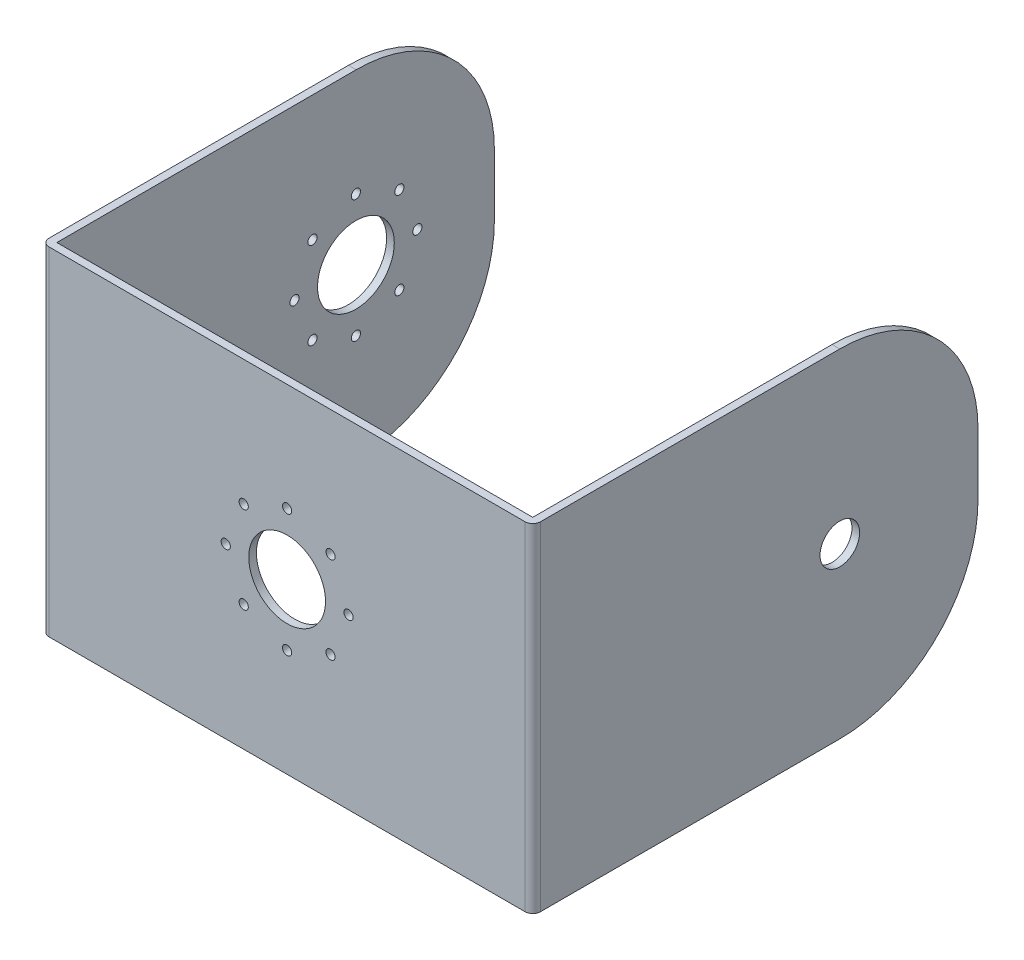
ISO-10303-21;
HEADER;
FILE_DESCRIPTION(('STEP AP214'),'2;1');
FILE_NAME('part.step','',(''),(''),'','','');
FILE_SCHEMA(('AUTOMOTIVE_DESIGN { 1 0 10303 214 1 1 1 1 }'));
ENDSEC;
DATA;
#1=APPLICATION_CONTEXT('core data for automotive mechanical design processes');
#2=APPLICATION_PROTOCOL_DEFINITION('international standard','automotive_design',2000,#1);
#3=PRODUCT_CONTEXT('',#1,'mechanical');
#4=PRODUCT('Part','Part','',(#3));
#5=PRODUCT_RELATED_PRODUCT_CATEGORY('part','',(#4));
#6=PRODUCT_DEFINITION_FORMATION('','',#4);
#7=PRODUCT_DEFINITION_CONTEXT('part definition',#1,'design');
#8=PRODUCT_DEFINITION('design','',#6,#7);
#9=PRODUCT_DEFINITION_SHAPE('','',#8);
#10=(LENGTH_UNIT() NAMED_UNIT(*) SI_UNIT(.MILLI.,.METRE.));
#11=(NAMED_UNIT(*) PLANE_ANGLE_UNIT() SI_UNIT($,.RADIAN.));
#12=(NAMED_UNIT(*) SI_UNIT($,.STERADIAN.) SOLID_ANGLE_UNIT());
#13=UNCERTAINTY_MEASURE_WITH_UNIT(LENGTH_MEASURE(1.E-05),#10,'distance_accuracy_value','');
#14=(GEOMETRIC_REPRESENTATION_CONTEXT(3) GLOBAL_UNCERTAINTY_ASSIGNED_CONTEXT((#13)) GLOBAL_UNIT_ASSIGNED_CONTEXT((#10,
#11,#12)) REPRESENTATION_CONTEXT('',''));
#15=CARTESIAN_POINT('',(0.,0.,0.));
#16=DIRECTION('',(0.,0.,1.));
#17=DIRECTION('',(1.,0.,0.));
#18=AXIS2_PLACEMENT_3D('',#15,#16,#17);
#19=CARTESIAN_POINT('',(32.,44.,0.));
#20=DIRECTION('',(-1.,0.,0.));
#21=DIRECTION('',(0.,0.,1.));
#22=AXIS2_PLACEMENT_3D('',#19,#20,#21);
#23=PLANE('',#22);
#24=CARTESIAN_POINT('',(32.,22.,-39.));
#25=DIRECTION('',(1.,0.,0.));
#26=DIRECTION('',(0.,0.,-1.));
#27=AXIS2_PLACEMENT_3D('',#24,#25,#26);
#28=CIRCLE('',#27,2.58);
#29=CARTESIAN_POINT('',(32.,22.,-41.58));
#30=VERTEX_POINT('',#29);
#31=EDGE_CURVE('E196',#30,#30,#28,.T.);
#32=ORIENTED_EDGE('',*,*,#31,.F.);
#33=EDGE_LOOP('',(#32));
#34=FACE_BOUND('',#33,.T.);
#35=DIRECTION('',(0.,0.,-1.));
#36=VECTOR('',#35,1.);
#37=CARTESIAN_POINT('',(32.,44.,0.));
#38=LINE('',#37,#36);
#39=CARTESIAN_POINT('',(32.,44.,0.));
#40=VERTEX_POINT('',#39);
#41=CARTESIAN_POINT('',(32.,44.,-39.));
#42=VERTEX_POINT('',#41);
#43=EDGE_CURVE('E155',#40,#42,#38,.T.);
#44=ORIENTED_EDGE('',*,*,#43,.F.);
#45=DIRECTION('',(0.,-1.,0.));
#46=VECTOR('',#45,1.);
#47=CARTESIAN_POINT('',(32.,44.,0.));
#48=LINE('',#47,#46);
#49=CARTESIAN_POINT('',(32.,0.,0.));
#50=VERTEX_POINT('',#49);
#51=EDGE_CURVE('E243',#40,#50,#48,.T.);
#52=ORIENTED_EDGE('',*,*,#51,.T.);
#53=DIRECTION('',(0.,0.,-1.));
#54=VECTOR('',#53,1.);
#55=CARTESIAN_POINT('',(32.,0.,0.));
#56=LINE('',#55,#54);
#57=CARTESIAN_POINT('',(32.,0.,-39.));
#58=VERTEX_POINT('',#57);
#59=EDGE_CURVE('E171',#50,#58,#56,.T.);
#60=ORIENTED_EDGE('',*,*,#59,.T.);
#61=CARTESIAN_POINT('',(32.,18.,-39.));
#62=DIRECTION('',(-1.,0.,0.));
#63=DIRECTION('',(0.,0.,1.));
#64=AXIS2_PLACEMENT_3D('',#61,#62,#63);
#65=CIRCLE('',#64,18.);
#66=CARTESIAN_POINT('',(32.,18.,-57.));
#67=VERTEX_POINT('',#66);
#68=EDGE_CURVE('E199',#58,#67,#65,.F.);
#69=ORIENTED_EDGE('',*,*,#68,.T.);
#70=DIRECTION('',(0.,-1.,0.));
#71=VECTOR('',#70,1.);
#72=CARTESIAN_POINT('',(32.,44.,-57.));
#73=LINE('',#72,#71);
#74=CARTESIAN_POINT('',(32.,26.,-57.));
#75=VERTEX_POINT('',#74);
#76=EDGE_CURVE('E191',#75,#67,#73,.T.);
#77=ORIENTED_EDGE('',*,*,#76,.F.);
#78=CARTESIAN_POINT('',(32.,26.,-39.));
#79=DIRECTION('',(-1.,0.,0.));
#80=DIRECTION('',(0.,0.,1.));
#81=AXIS2_PLACEMENT_3D('',#78,#79,#80);
#82=CIRCLE('',#81,18.);
#83=EDGE_CURVE('E210',#75,#42,#82,.F.);
#84=ORIENTED_EDGE('',*,*,#83,.T.);
#85=EDGE_LOOP('',(#44,#52,#60,#69,#77,#84));
#86=FACE_BOUND('',#85,.T.);
#87=ADVANCED_FACE('F33',(#34,#86),#23,.F.);
#88=CARTESIAN_POINT('',(31.,44.,-57.));
#89=DIRECTION('',(0.,0.,-1.));
#90=DIRECTION('',(-1.,0.,0.));
#91=AXIS2_PLACEMENT_3D('',#88,#89,#90);
#92=PLANE('',#91);
#93=DIRECTION('',(0.,-1.,0.));
#94=VECTOR('',#93,1.);
#95=CARTESIAN_POINT('',(31.,44.,-57.));
#96=LINE('',#95,#94);
#97=CARTESIAN_POINT('',(31.,26.,-57.));
#98=VERTEX_POINT('',#97);
#99=CARTESIAN_POINT('',(31.,18.,-57.));
#100=VERTEX_POINT('',#99);
#101=EDGE_CURVE('E145',#98,#100,#96,.T.);
#102=ORIENTED_EDGE('',*,*,#101,.F.);
#103=DIRECTION('',(1.,0.,0.));
#104=VECTOR('',#103,1.);
#105=CARTESIAN_POINT('',(32.,26.,-57.));
#106=LINE('',#105,#104);
#107=EDGE_CURVE('E207',#98,#75,#106,.T.);
#108=ORIENTED_EDGE('',*,*,#107,.T.);
#109=ORIENTED_EDGE('',*,*,#76,.T.);
#110=DIRECTION('',(1.,0.,0.));
#111=VECTOR('',#110,1.);
#112=CARTESIAN_POINT('',(31.,18.,-57.));
#113=LINE('',#112,#111);
#114=EDGE_CURVE('E202',#67,#100,#113,.F.);
#115=ORIENTED_EDGE('',*,*,#114,.T.);
#116=EDGE_LOOP('',(#102,#108,#109,#115));
#117=FACE_BOUND('',#116,.T.);
#118=ADVANCED_FACE('F261',(#117),#92,.T.);
#119=CARTESIAN_POINT('',(31.,44.,0.));
#120=DIRECTION('',(-1.,0.,0.));
#121=DIRECTION('',(0.,0.,1.));
#122=AXIS2_PLACEMENT_3D('',#119,#120,#121);
#123=PLANE('',#122);
#124=CARTESIAN_POINT('',(31.,22.,-39.));
#125=DIRECTION('',(-1.,0.,0.));
#126=DIRECTION('',(0.,0.,1.));
#127=AXIS2_PLACEMENT_3D('',#124,#125,#126);
#128=CIRCLE('',#127,2.58);
#129=CARTESIAN_POINT('',(31.,22.,-36.42));
#130=VERTEX_POINT('',#129);
#131=EDGE_CURVE('E173',#130,#130,#128,.T.);
#132=ORIENTED_EDGE('',*,*,#131,.F.);
#133=EDGE_LOOP('',(#132));
#134=FACE_BOUND('',#133,.T.);
#135=DIRECTION('',(0.,0.,-1.));
#136=VECTOR('',#135,1.);
#137=CARTESIAN_POINT('',(31.,44.,0.));
#138=LINE('',#137,#136);
#139=CARTESIAN_POINT('',(31.,44.,0.));
#140=VERTEX_POINT('',#139);
#141=CARTESIAN_POINT('',(31.,44.,-39.));
#142=VERTEX_POINT('',#141);
#143=EDGE_CURVE('E137',#140,#142,#138,.T.);
#144=ORIENTED_EDGE('',*,*,#143,.T.);
#145=CARTESIAN_POINT('',(31.,26.,-39.));
#146=DIRECTION('',(-1.,0.,0.));
#147=DIRECTION('',(0.,0.,1.));
#148=AXIS2_PLACEMENT_3D('',#145,#146,#147);
#149=CIRCLE('',#148,18.);
#150=EDGE_CURVE('E214',#142,#98,#149,.T.);
#151=ORIENTED_EDGE('',*,*,#150,.T.);
#152=ORIENTED_EDGE('',*,*,#101,.T.);
#153=CARTESIAN_POINT('',(31.,18.,-39.));
#154=DIRECTION('',(-1.,0.,0.));
#155=DIRECTION('',(0.,0.,1.));
#156=AXIS2_PLACEMENT_3D('',#153,#154,#155);
#157=CIRCLE('',#156,18.);
#158=CARTESIAN_POINT('',(31.,0.,-39.));
#159=VERTEX_POINT('',#158);
#160=EDGE_CURVE('E205',#100,#159,#157,.T.);
#161=ORIENTED_EDGE('',*,*,#160,.T.);
#162=DIRECTION('',(0.,0.,-1.));
#163=VECTOR('',#162,1.);
#164=CARTESIAN_POINT('',(31.,0.,0.));
#165=LINE('',#164,#163);
#166=CARTESIAN_POINT('',(31.,0.,0.));
#167=VERTEX_POINT('',#166);
#168=EDGE_CURVE('E140',#167,#159,#165,.T.);
#169=ORIENTED_EDGE('',*,*,#168,.F.);
#170=DIRECTION('',(0.,-1.,0.));
#171=VECTOR('',#170,1.);
#172=CARTESIAN_POINT('',(31.,44.,0.));
#173=LINE('',#172,#171);
#174=EDGE_CURVE('E134',#140,#167,#173,.T.);
#175=ORIENTED_EDGE('',*,*,#174,.F.);
#176=EDGE_LOOP('',(#144,#151,#152,#161,#169,#175));
#177=FACE_BOUND('',#176,.T.);
#178=ADVANCED_FACE('F136',(#134,#177),#123,.T.);
#179=CARTESIAN_POINT('',(31.,44.,0.));
#180=DIRECTION('',(0.,0.,-1.));
#181=DIRECTION('',(-1.,0.,0.));
#182=AXIS2_PLACEMENT_3D('',#179,#180,#181);
#183=PLANE('',#182);
#184=CARTESIAN_POINT('',(0.,30.,0.));
#185=DIRECTION('',(0.,0.,-1.));
#186=DIRECTION('',(-1.,0.,0.));
#187=AXIS2_PLACEMENT_3D('',#184,#185,#186);
#188=CIRCLE('',#187,0.6);
#189=CARTESIAN_POINT('',(-0.6,30.,0.));
#190=VERTEX_POINT('',#189);
#191=EDGE_CURVE('E391',#190,#190,#188,.T.);
#192=ORIENTED_EDGE('',*,*,#191,.F.);
#193=EDGE_LOOP('',(#192));
#194=FACE_BOUND('',#193,.T.);
#195=CARTESIAN_POINT('',(-5.65685424949241,27.6568542494923,0.));
#196=DIRECTION('',(0.,0.,-1.));
#197=DIRECTION('',(-1.,0.,0.));
#198=AXIS2_PLACEMENT_3D('',#195,#196,#197);
#199=CIRCLE('',#198,0.6);
#200=CARTESIAN_POINT('',(-6.25685424949241,27.6568542494923,0.));
#201=VERTEX_POINT('',#200);
#202=EDGE_CURVE('E442',#201,#201,#199,.T.);
#203=ORIENTED_EDGE('',*,*,#202,.F.);
#204=EDGE_LOOP('',(#203));
#205=FACE_BOUND('',#204,.T.);
#206=CARTESIAN_POINT('',(-8.,22.,0.));
#207=DIRECTION('',(0.,0.,-1.));
#208=DIRECTION('',(-1.,0.,0.));
#209=AXIS2_PLACEMENT_3D('',#206,#207,#208);
#210=CIRCLE('',#209,0.6);
#211=CARTESIAN_POINT('',(-8.6,22.,0.));
#212=VERTEX_POINT('',#211);
#213=EDGE_CURVE('E439',#212,#212,#210,.T.);
#214=ORIENTED_EDGE('',*,*,#213,.F.);
#215=EDGE_LOOP('',(#214));
#216=FACE_BOUND('',#215,.T.);
#217=CARTESIAN_POINT('',(-5.65685424949233,16.3431457505076,0.));
#218=DIRECTION('',(0.,0.,-1.));
#219=DIRECTION('',(-1.,0.,0.));
#220=AXIS2_PLACEMENT_3D('',#217,#218,#219);
#221=CIRCLE('',#220,0.6);
#222=CARTESIAN_POINT('',(-6.25685424949233,16.3431457505076,0.));
#223=VERTEX_POINT('',#222);
#224=EDGE_CURVE('E436',#223,#223,#221,.T.);
#225=ORIENTED_EDGE('',*,*,#224,.F.);
#226=EDGE_LOOP('',(#225));
#227=FACE_BOUND('',#226,.T.);
#228=CARTESIAN_POINT('',(0.,14.,0.));
#229=DIRECTION('',(0.,0.,-1.));
#230=DIRECTION('',(-1.,0.,0.));
#231=AXIS2_PLACEMENT_3D('',#228,#229,#230);
#232=CIRCLE('',#231,0.6);
#233=CARTESIAN_POINT('',(-0.6,14.,0.));
#234=VERTEX_POINT('',#233);
#235=EDGE_CURVE('E433',#234,#234,#232,.T.);
#236=ORIENTED_EDGE('',*,*,#235,.F.);
#237=EDGE_LOOP('',(#236));
#238=FACE_BOUND('',#237,.T.);
#239=CARTESIAN_POINT('',(5.65685424949237,27.6568542494924,0.));
#240=DIRECTION('',(0.,0.,-1.));
#241=DIRECTION('',(-1.,0.,0.));
#242=AXIS2_PLACEMENT_3D('',#239,#240,#241);
#243=CIRCLE('',#242,0.6);
#244=CARTESIAN_POINT('',(5.05685424949237,27.6568542494924,0.));
#245=VERTEX_POINT('',#244);
#246=EDGE_CURVE('E430',#245,#245,#243,.T.);
#247=ORIENTED_EDGE('',*,*,#246,.F.);
#248=EDGE_LOOP('',(#247));
#249=FACE_BOUND('',#248,.T.);
#250=CARTESIAN_POINT('',(8.,22.,0.));
#251=DIRECTION('',(0.,0.,-1.));
#252=DIRECTION('',(-1.,0.,0.));
#253=AXIS2_PLACEMENT_3D('',#250,#251,#252);
#254=CIRCLE('',#253,0.6);
#255=CARTESIAN_POINT('',(7.4,22.,0.));
#256=VERTEX_POINT('',#255);
#257=EDGE_CURVE('E427',#256,#256,#254,.T.);
#258=ORIENTED_EDGE('',*,*,#257,.F.);
#259=EDGE_LOOP('',(#258));
#260=FACE_BOUND('',#259,.T.);
#261=CARTESIAN_POINT('',(0.,22.,0.));
#262=DIRECTION('',(0.,0.,-1.));
#263=DIRECTION('',(-1.,0.,0.));
#264=AXIS2_PLACEMENT_3D('',#261,#262,#263);
#265=CIRCLE('',#264,5.);
#266=CARTESIAN_POINT('',(-5.,22.,0.));
#267=VERTEX_POINT('',#266);
#268=EDGE_CURVE('E399',#267,#267,#265,.T.);
#269=ORIENTED_EDGE('',*,*,#268,.F.);
#270=EDGE_LOOP('',(#269));
#271=FACE_BOUND('',#270,.T.);
#272=CARTESIAN_POINT('',(5.65685424949245,16.3431457505077,0.));
#273=DIRECTION('',(0.,0.,-1.));
#274=DIRECTION('',(-1.,0.,0.));
#275=AXIS2_PLACEMENT_3D('',#272,#273,#274);
#276=CIRCLE('',#275,0.6);
#277=CARTESIAN_POINT('',(5.05685424949245,16.3431457505077,0.));
#278=VERTEX_POINT('',#277);
#279=EDGE_CURVE('E395',#278,#278,#276,.T.);
#280=ORIENTED_EDGE('',*,*,#279,.F.);
#281=EDGE_LOOP('',(#280));
#282=FACE_BOUND('',#281,.T.);
#283=DIRECTION('',(1.,0.,0.));
#284=VECTOR('',#283,1.);
#285=CARTESIAN_POINT('',(31.,0.,0.));
#286=LINE('',#285,#284);
#287=CARTESIAN_POINT('',(-31.,0.,0.));
#288=VERTEX_POINT('',#287);
#289=EDGE_CURVE('E175',#288,#167,#286,.T.);
#290=ORIENTED_EDGE('',*,*,#289,.F.);
#291=DIRECTION('',(0.,-1.,0.));
#292=VECTOR('',#291,1.);
#293=CARTESIAN_POINT('',(-31.,44.,0.));
#294=LINE('',#293,#292);
#295=CARTESIAN_POINT('',(-31.,44.,0.));
#296=VERTEX_POINT('',#295);
#297=EDGE_CURVE('E146',#296,#288,#294,.T.);
#298=ORIENTED_EDGE('',*,*,#297,.F.);
#299=DIRECTION('',(1.,0.,0.));
#300=VECTOR('',#299,1.);
#301=CARTESIAN_POINT('',(31.,44.,0.));
#302=LINE('',#301,#300);
#303=EDGE_CURVE('E152',#296,#140,#302,.T.);
#304=ORIENTED_EDGE('',*,*,#303,.T.);
#305=ORIENTED_EDGE('',*,*,#174,.T.);
#306=EDGE_LOOP('',(#290,#298,#304,#305));
#307=FACE_BOUND('',#306,.T.);
#308=ADVANCED_FACE('F158',(#194,#205,#216,#227,#238,#249,#260,#271,#282,#307),#183,.T.);
#309=CARTESIAN_POINT('',(-31.,44.,0.));
#310=DIRECTION('',(1.,0.,0.));
#311=DIRECTION('',(0.,0.,-1.));
#312=AXIS2_PLACEMENT_3D('',#309,#310,#311);
#313=PLANE('',#312);
#314=CARTESIAN_POINT('',(-31.,14.,-38.9610030090714));
#315=DIRECTION('',(1.,0.,0.));
#316=DIRECTION('',(0.,0.,-1.));
#317=AXIS2_PLACEMENT_3D('',#314,#315,#316);
#318=CIRCLE('',#317,0.600000000000001);
#319=CARTESIAN_POINT('',(-31.,14.,-39.5610030090714));
#320=VERTEX_POINT('',#319);
#321=EDGE_CURVE('E497',#320,#320,#318,.T.);
#322=ORIENTED_EDGE('',*,*,#321,.F.);
#323=EDGE_LOOP('',(#322));
#324=FACE_BOUND('',#323,.T.);
#325=CARTESIAN_POINT('',(-31.,22.,-30.9610030090714));
#326=DIRECTION('',(1.,0.,0.));
#327=DIRECTION('',(0.,0.,-1.));
#328=AXIS2_PLACEMENT_3D('',#325,#326,#327);
#329=CIRCLE('',#328,0.6);
#330=CARTESIAN_POINT('',(-31.,22.,-31.5610030090714));
#331=VERTEX_POINT('',#330);
#332=EDGE_CURVE('E494',#331,#331,#329,.T.);
#333=ORIENTED_EDGE('',*,*,#332,.F.);
#334=EDGE_LOOP('',(#333));
#335=FACE_BOUND('',#334,.T.);
#336=CARTESIAN_POINT('',(-31.,30.,-38.9610030090714));
#337=DIRECTION('',(1.,0.,0.));
#338=DIRECTION('',(0.,0.,-1.));
#339=AXIS2_PLACEMENT_3D('',#336,#337,#338);
#340=CIRCLE('',#339,0.6);
#341=CARTESIAN_POINT('',(-31.,30.,-39.5610030090714));
#342=VERTEX_POINT('',#341);
#343=EDGE_CURVE('E491',#342,#342,#340,.T.);
#344=ORIENTED_EDGE('',*,*,#343,.F.);
#345=EDGE_LOOP('',(#344));
#346=FACE_BOUND('',#345,.T.);
#347=CARTESIAN_POINT('',(-31.,22.,-38.9610030090714));
#348=DIRECTION('',(1.,0.,0.));
#349=DIRECTION('',(0.,0.,-1.));
#350=AXIS2_PLACEMENT_3D('',#347,#348,#349);
#351=CIRCLE('',#350,5.);
#352=CARTESIAN_POINT('',(-31.,22.,-43.9610030090714));
#353=VERTEX_POINT('',#352);
#354=EDGE_CURVE('E488',#353,#353,#351,.T.);
#355=ORIENTED_EDGE('',*,*,#354,.F.);
#356=EDGE_LOOP('',(#355));
#357=FACE_BOUND('',#356,.T.);
#358=CARTESIAN_POINT('',(-31.,22.,-46.9610030090714));
#359=DIRECTION('',(1.,0.,0.));
#360=DIRECTION('',(0.,0.,-1.));
#361=AXIS2_PLACEMENT_3D('',#358,#359,#360);
#362=CIRCLE('',#361,0.6);
#363=CARTESIAN_POINT('',(-31.,22.,-47.5610030090714));
#364=VERTEX_POINT('',#363);
#365=EDGE_CURVE('E485',#364,#364,#362,.T.);
#366=ORIENTED_EDGE('',*,*,#365,.F.);
#367=EDGE_LOOP('',(#366));
#368=FACE_BOUND('',#367,.T.);
#369=CARTESIAN_POINT('',(-31.,27.6568542494924,-33.304148759579));
#370=DIRECTION('',(1.,0.,0.));
#371=DIRECTION('',(0.,0.,-1.));
#372=AXIS2_PLACEMENT_3D('',#369,#370,#371);
#373=CIRCLE('',#372,0.6);
#374=CARTESIAN_POINT('',(-31.,27.6568542494924,-33.904148759579));
#375=VERTEX_POINT('',#374);
#376=EDGE_CURVE('E482',#375,#375,#373,.T.);
#377=ORIENTED_EDGE('',*,*,#376,.F.);
#378=EDGE_LOOP('',(#377));
#379=FACE_BOUND('',#378,.T.);
#380=CARTESIAN_POINT('',(-31.,16.3431457505077,-33.3041487595789));
#381=DIRECTION('',(1.,0.,0.));
#382=DIRECTION('',(0.,0.,-1.));
#383=AXIS2_PLACEMENT_3D('',#380,#381,#382);
#384=CIRCLE('',#383,0.6);
#385=CARTESIAN_POINT('',(-31.,16.3431457505077,-33.9041487595789));
#386=VERTEX_POINT('',#385);
#387=EDGE_CURVE('E479',#386,#386,#384,.T.);
#388=ORIENTED_EDGE('',*,*,#387,.F.);
#389=EDGE_LOOP('',(#388));
#390=FACE_BOUND('',#389,.T.);
#391=CARTESIAN_POINT('',(-31.,16.3431457505076,-44.6178572585637));
#392=DIRECTION('',(1.,0.,0.));
#393=DIRECTION('',(0.,0.,-1.));
#394=AXIS2_PLACEMENT_3D('',#391,#392,#393);
#395=CIRCLE('',#394,0.6);
#396=CARTESIAN_POINT('',(-31.,16.3431457505076,-45.2178572585637));
#397=VERTEX_POINT('',#396);
#398=EDGE_CURVE('E476',#397,#397,#395,.T.);
#399=ORIENTED_EDGE('',*,*,#398,.F.);
#400=EDGE_LOOP('',(#399));
#401=FACE_BOUND('',#400,.T.);
#402=CARTESIAN_POINT('',(-31.,27.6568542494923,-44.6178572585638));
#403=DIRECTION('',(1.,0.,0.));
#404=DIRECTION('',(0.,0.,-1.));
#405=AXIS2_PLACEMENT_3D('',#402,#403,#404);
#406=CIRCLE('',#405,0.6);
#407=CARTESIAN_POINT('',(-31.,27.6568542494923,-45.2178572585638));
#408=VERTEX_POINT('',#407);
#409=EDGE_CURVE('E473',#408,#408,#406,.T.);
#410=ORIENTED_EDGE('',*,*,#409,.F.);
#411=EDGE_LOOP('',(#410));
#412=FACE_BOUND('',#411,.T.);
#413=DIRECTION('',(0.,0.,1.));
#414=VECTOR('',#413,1.);
#415=CARTESIAN_POINT('',(-31.,0.,0.));
#416=LINE('',#415,#414);
#417=CARTESIAN_POINT('',(-31.,0.,-39.));
#418=VERTEX_POINT('',#417);
#419=EDGE_CURVE('E177',#418,#288,#416,.T.);
#420=ORIENTED_EDGE('',*,*,#419,.F.);
#421=CARTESIAN_POINT('',(-31.,18.,-39.));
#422=DIRECTION('',(1.,0.,0.));
#423=DIRECTION('',(0.,0.,-1.));
#424=AXIS2_PLACEMENT_3D('',#421,#422,#423);
#425=CIRCLE('',#424,18.);
#426=CARTESIAN_POINT('',(-31.,18.,-57.));
#427=VERTEX_POINT('',#426);
#428=EDGE_CURVE('E228',#418,#427,#425,.T.);
#429=ORIENTED_EDGE('',*,*,#428,.T.);
#430=DIRECTION('',(0.,-1.,0.));
#431=VECTOR('',#430,1.);
#432=CARTESIAN_POINT('',(-31.,44.,-57.));
#433=LINE('',#432,#431);
#434=CARTESIAN_POINT('',(-31.,26.,-57.));
#435=VERTEX_POINT('',#434);
#436=EDGE_CURVE('E186',#435,#427,#433,.T.);
#437=ORIENTED_EDGE('',*,*,#436,.F.);
#438=CARTESIAN_POINT('',(-31.,26.,-39.));
#439=DIRECTION('',(1.,0.,0.));
#440=DIRECTION('',(0.,0.,-1.));
#441=AXIS2_PLACEMENT_3D('',#438,#439,#440);
#442=CIRCLE('',#441,18.);
#443=CARTESIAN_POINT('',(-31.,44.,-39.));
#444=VERTEX_POINT('',#443);
#445=EDGE_CURVE('E219',#435,#444,#442,.T.);
#446=ORIENTED_EDGE('',*,*,#445,.T.);
#447=DIRECTION('',(0.,0.,1.));
#448=VECTOR('',#447,1.);
#449=CARTESIAN_POINT('',(-31.,44.,0.));
#450=LINE('',#449,#448);
#451=EDGE_CURVE('E160',#444,#296,#450,.T.);
#452=ORIENTED_EDGE('',*,*,#451,.T.);
#453=ORIENTED_EDGE('',*,*,#297,.T.);
#454=EDGE_LOOP('',(#420,#429,#437,#446,#452,#453));
#455=FACE_BOUND('',#454,.T.);
#456=ADVANCED_FACE('F291',(#324,#335,#346,#357,#368,#379,#390,#401,#412,#455),#313,.T.);
#457=CARTESIAN_POINT('',(-32.,44.,-57.));
#458=DIRECTION('',(0.,0.,-1.));
#459=DIRECTION('',(-1.,0.,0.));
#460=AXIS2_PLACEMENT_3D('',#457,#458,#459);
#461=PLANE('',#460);
#462=ORIENTED_EDGE('',*,*,#436,.T.);
#463=DIRECTION('',(1.,0.,0.));
#464=VECTOR('',#463,1.);
#465=CARTESIAN_POINT('',(-32.,18.,-57.));
#466=LINE('',#465,#464);
#467=CARTESIAN_POINT('',(-32.,18.,-57.));
#468=VERTEX_POINT('',#467);
#469=EDGE_CURVE('E230',#427,#468,#466,.F.);
#470=ORIENTED_EDGE('',*,*,#469,.T.);
#471=DIRECTION('',(0.,-1.,0.));
#472=VECTOR('',#471,1.);
#473=CARTESIAN_POINT('',(-32.,44.,-57.));
#474=LINE('',#473,#472);
#475=CARTESIAN_POINT('',(-32.,26.,-57.));
#476=VERTEX_POINT('',#475);
#477=EDGE_CURVE('E170',#476,#468,#474,.T.);
#478=ORIENTED_EDGE('',*,*,#477,.F.);
#479=DIRECTION('',(1.,0.,0.));
#480=VECTOR('',#479,1.);
#481=CARTESIAN_POINT('',(-31.,26.,-57.));
#482=LINE('',#481,#480);
#483=EDGE_CURVE('E216',#476,#435,#482,.T.);
#484=ORIENTED_EDGE('',*,*,#483,.T.);
#485=EDGE_LOOP('',(#462,#470,#478,#484));
#486=FACE_BOUND('',#485,.T.);
#487=ADVANCED_FACE('F295',(#486),#461,.T.);
#488=CARTESIAN_POINT('',(-32.,44.,0.));
#489=DIRECTION('',(1.,0.,0.));
#490=DIRECTION('',(0.,0.,-1.));
#491=AXIS2_PLACEMENT_3D('',#488,#489,#490);
#492=PLANE('',#491);
#493=CARTESIAN_POINT('',(-32.,14.,-38.9610030090714));
#494=DIRECTION('',(-1.,0.,0.));
#495=DIRECTION('',(0.,0.,1.));
#496=AXIS2_PLACEMENT_3D('',#493,#494,#495);
#497=CIRCLE('',#496,0.600000000000001);
#498=CARTESIAN_POINT('',(-32.,14.,-38.3610030090714));
#499=VERTEX_POINT('',#498);
#500=EDGE_CURVE('E450',#499,#499,#497,.T.);
#501=ORIENTED_EDGE('',*,*,#500,.F.);
#502=EDGE_LOOP('',(#501));
#503=FACE_BOUND('',#502,.T.);
#504=CARTESIAN_POINT('',(-32.,22.,-30.9610030090714));
#505=DIRECTION('',(-1.,0.,0.));
#506=DIRECTION('',(0.,0.,1.));
#507=AXIS2_PLACEMENT_3D('',#504,#505,#506);
#508=CIRCLE('',#507,0.6);
#509=CARTESIAN_POINT('',(-32.,22.,-30.3610030090714));
#510=VERTEX_POINT('',#509);
#511=EDGE_CURVE('E459',#510,#510,#508,.T.);
#512=ORIENTED_EDGE('',*,*,#511,.F.);
#513=EDGE_LOOP('',(#512));
#514=FACE_BOUND('',#513,.T.);
#515=CARTESIAN_POINT('',(-32.,30.,-38.9610030090714));
#516=DIRECTION('',(-1.,0.,0.));
#517=DIRECTION('',(0.,0.,1.));
#518=AXIS2_PLACEMENT_3D('',#515,#516,#517);
#519=CIRCLE('',#518,0.6);
#520=CARTESIAN_POINT('',(-32.,30.,-38.3610030090714));
#521=VERTEX_POINT('',#520);
#522=EDGE_CURVE('E462',#521,#521,#519,.T.);
#523=ORIENTED_EDGE('',*,*,#522,.F.);
#524=EDGE_LOOP('',(#523));
#525=FACE_BOUND('',#524,.T.);
#526=CARTESIAN_POINT('',(-32.,22.,-38.9610030090714));
#527=DIRECTION('',(-1.,0.,0.));
#528=DIRECTION('',(0.,0.,1.));
#529=AXIS2_PLACEMENT_3D('',#526,#527,#528);
#530=CIRCLE('',#529,5.);
#531=CARTESIAN_POINT('',(-32.,22.,-33.9610030090714));
#532=VERTEX_POINT('',#531);
#533=EDGE_CURVE('E465',#532,#532,#530,.T.);
#534=ORIENTED_EDGE('',*,*,#533,.F.);
#535=EDGE_LOOP('',(#534));
#536=FACE_BOUND('',#535,.T.);
#537=CARTESIAN_POINT('',(-32.,22.,-46.9610030090714));
#538=DIRECTION('',(-1.,0.,0.));
#539=DIRECTION('',(0.,0.,1.));
#540=AXIS2_PLACEMENT_3D('',#537,#538,#539);
#541=CIRCLE('',#540,0.6);
#542=CARTESIAN_POINT('',(-32.,22.,-46.3610030090714));
#543=VERTEX_POINT('',#542);
#544=EDGE_CURVE('E447',#543,#543,#541,.T.);
#545=ORIENTED_EDGE('',*,*,#544,.F.);
#546=EDGE_LOOP('',(#545));
#547=FACE_BOUND('',#546,.T.);
#548=CARTESIAN_POINT('',(-32.,27.6568542494924,-33.304148759579));
#549=DIRECTION('',(-1.,0.,0.));
#550=DIRECTION('',(0.,0.,1.));
#551=AXIS2_PLACEMENT_3D('',#548,#549,#550);
#552=CIRCLE('',#551,0.6);
#553=CARTESIAN_POINT('',(-32.,27.6568542494924,-32.704148759579));
#554=VERTEX_POINT('',#553);
#555=EDGE_CURVE('E451',#554,#554,#552,.T.);
#556=ORIENTED_EDGE('',*,*,#555,.F.);
#557=EDGE_LOOP('',(#556));
#558=FACE_BOUND('',#557,.T.);
#559=CARTESIAN_POINT('',(-32.,16.3431457505077,-33.3041487595789));
#560=DIRECTION('',(-1.,0.,0.));
#561=DIRECTION('',(0.,0.,1.));
#562=AXIS2_PLACEMENT_3D('',#559,#560,#561);
#563=CIRCLE('',#562,0.6);
#564=CARTESIAN_POINT('',(-32.,16.3431457505077,-32.7041487595789));
#565=VERTEX_POINT('',#564);
#566=EDGE_CURVE('E454',#565,#565,#563,.T.);
#567=ORIENTED_EDGE('',*,*,#566,.F.);
#568=EDGE_LOOP('',(#567));
#569=FACE_BOUND('',#568,.T.);
#570=CARTESIAN_POINT('',(-32.,16.3431457505076,-44.6178572585637));
#571=DIRECTION('',(-1.,0.,0.));
#572=DIRECTION('',(0.,0.,1.));
#573=AXIS2_PLACEMENT_3D('',#570,#571,#572);
#574=CIRCLE('',#573,0.6);
#575=CARTESIAN_POINT('',(-32.,16.3431457505076,-44.0178572585637));
#576=VERTEX_POINT('',#575);
#577=EDGE_CURVE('E446',#576,#576,#574,.T.);
#578=ORIENTED_EDGE('',*,*,#577,.F.);
#579=EDGE_LOOP('',(#578));
#580=FACE_BOUND('',#579,.T.);
#581=CARTESIAN_POINT('',(-32.,27.6568542494923,-44.6178572585638));
#582=DIRECTION('',(-1.,0.,0.));
#583=DIRECTION('',(0.,0.,1.));
#584=AXIS2_PLACEMENT_3D('',#581,#582,#583);
#585=CIRCLE('',#584,0.6);
#586=CARTESIAN_POINT('',(-32.,27.6568542494923,-44.0178572585638));
#587=VERTEX_POINT('',#586);
#588=EDGE_CURVE('E468',#587,#587,#585,.T.);
#589=ORIENTED_EDGE('',*,*,#588,.F.);
#590=EDGE_LOOP('',(#589));
#591=FACE_BOUND('',#590,.T.);
#592=DIRECTION('',(0.,0.,-1.));
#593=VECTOR('',#592,1.);
#594=CARTESIAN_POINT('',(-32.,0.,0.));
#595=LINE('',#594,#593);
#596=CARTESIAN_POINT('',(-32.,0.,-39.));
#597=VERTEX_POINT('',#596);
#598=CARTESIAN_POINT('',(-32.,0.,0.));
#599=VERTEX_POINT('',#598);
#600=EDGE_CURVE('E179',#597,#599,#595,.F.);
#601=ORIENTED_EDGE('',*,*,#600,.T.);
#602=DIRECTION('',(0.,-1.,0.));
#603=VECTOR('',#602,1.);
#604=CARTESIAN_POINT('',(-32.,44.,0.));
#605=LINE('',#604,#603);
#606=CARTESIAN_POINT('',(-32.,44.,0.));
#607=VERTEX_POINT('',#606);
#608=EDGE_CURVE('E239',#599,#607,#605,.F.);
#609=ORIENTED_EDGE('',*,*,#608,.T.);
#610=DIRECTION('',(0.,0.,-1.));
#611=VECTOR('',#610,1.);
#612=CARTESIAN_POINT('',(-32.,44.,0.));
#613=LINE('',#612,#611);
#614=CARTESIAN_POINT('',(-32.,44.,-39.));
#615=VERTEX_POINT('',#614);
#616=EDGE_CURVE('E162',#615,#607,#613,.F.);
#617=ORIENTED_EDGE('',*,*,#616,.F.);
#618=CARTESIAN_POINT('',(-32.,26.,-39.));
#619=DIRECTION('',(1.,0.,0.));
#620=DIRECTION('',(0.,0.,-1.));
#621=AXIS2_PLACEMENT_3D('',#618,#619,#620);
#622=CIRCLE('',#621,18.);
#623=EDGE_CURVE('E223',#615,#476,#622,.F.);
#624=ORIENTED_EDGE('',*,*,#623,.T.);
#625=ORIENTED_EDGE('',*,*,#477,.T.);
#626=CARTESIAN_POINT('',(-32.,18.,-39.));
#627=DIRECTION('',(1.,0.,0.));
#628=DIRECTION('',(0.,0.,-1.));
#629=AXIS2_PLACEMENT_3D('',#626,#627,#628);
#630=CIRCLE('',#629,18.);
#631=EDGE_CURVE('E232',#468,#597,#630,.F.);
#632=ORIENTED_EDGE('',*,*,#631,.T.);
#633=EDGE_LOOP('',(#601,#609,#617,#624,#625,#632));
#634=FACE_BOUND('',#633,.T.);
#635=ADVANCED_FACE('F299',(#503,#514,#525,#536,#547,#558,#569,#580,#591,#634),#492,.F.);
#636=CARTESIAN_POINT('',(31.,44.,0.999999999999989));
#637=DIRECTION('',(0.,0.,-1.));
#638=DIRECTION('',(-1.,0.,0.));
#639=AXIS2_PLACEMENT_3D('',#636,#637,#638);
#640=PLANE('',#639);
#641=CARTESIAN_POINT('',(0.,30.,0.999999999999998));
#642=DIRECTION('',(0.,0.,1.));
#643=DIRECTION('',(1.,0.,0.));
#644=AXIS2_PLACEMENT_3D('',#641,#642,#643);
#645=CIRCLE('',#644,0.6);
#646=CARTESIAN_POINT('',(0.6,30.,0.999999999999998));
#647=VERTEX_POINT('',#646);
#648=EDGE_CURVE('E394',#647,#647,#645,.T.);
#649=ORIENTED_EDGE('',*,*,#648,.F.);
#650=EDGE_LOOP('',(#649));
#651=FACE_BOUND('',#650,.T.);
#652=CARTESIAN_POINT('',(-5.65685424949241,27.6568542494923,0.999999999999998));
#653=DIRECTION('',(0.,0.,1.));
#654=DIRECTION('',(1.,0.,0.));
#655=AXIS2_PLACEMENT_3D('',#652,#653,#654);
#656=CIRCLE('',#655,0.6);
#657=CARTESIAN_POINT('',(-5.05685424949241,27.6568542494923,0.999999999999998));
#658=VERTEX_POINT('',#657);
#659=EDGE_CURVE('E415',#658,#658,#656,.T.);
#660=ORIENTED_EDGE('',*,*,#659,.F.);
#661=EDGE_LOOP('',(#660));
#662=FACE_BOUND('',#661,.T.);
#663=CARTESIAN_POINT('',(-8.,22.,0.999999999999998));
#664=DIRECTION('',(0.,0.,1.));
#665=DIRECTION('',(1.,0.,0.));
#666=AXIS2_PLACEMENT_3D('',#663,#664,#665);
#667=CIRCLE('',#666,0.6);
#668=CARTESIAN_POINT('',(-7.4,22.,0.999999999999998));
#669=VERTEX_POINT('',#668);
#670=EDGE_CURVE('E412',#669,#669,#667,.T.);
#671=ORIENTED_EDGE('',*,*,#670,.F.);
#672=EDGE_LOOP('',(#671));
#673=FACE_BOUND('',#672,.T.);
#674=CARTESIAN_POINT('',(-5.65685424949233,16.3431457505076,0.999999999999998));
#675=DIRECTION('',(0.,0.,1.));
#676=DIRECTION('',(1.,0.,0.));
#677=AXIS2_PLACEMENT_3D('',#674,#675,#676);
#678=CIRCLE('',#677,0.6);
#679=CARTESIAN_POINT('',(-5.05685424949233,16.3431457505076,0.999999999999998));
#680=VERTEX_POINT('',#679);
#681=EDGE_CURVE('E409',#680,#680,#678,.T.);
#682=ORIENTED_EDGE('',*,*,#681,.F.);
#683=EDGE_LOOP('',(#682));
#684=FACE_BOUND('',#683,.T.);
#685=CARTESIAN_POINT('',(0.,14.,0.999999999999998));
#686=DIRECTION('',(0.,0.,1.));
#687=DIRECTION('',(1.,0.,0.));
#688=AXIS2_PLACEMENT_3D('',#685,#686,#687);
#689=CIRCLE('',#688,0.6);
#690=CARTESIAN_POINT('',(0.6,14.,0.999999999999998));
#691=VERTEX_POINT('',#690);
#692=EDGE_CURVE('E405',#691,#691,#689,.T.);
#693=ORIENTED_EDGE('',*,*,#692,.F.);
#694=EDGE_LOOP('',(#693));
#695=FACE_BOUND('',#694,.T.);
#696=CARTESIAN_POINT('',(5.65685424949237,27.6568542494924,0.999999999999998));
#697=DIRECTION('',(0.,0.,1.));
#698=DIRECTION('',(1.,0.,0.));
#699=AXIS2_PLACEMENT_3D('',#696,#697,#698);
#700=CIRCLE('',#699,0.6);
#701=CARTESIAN_POINT('',(6.25685424949237,27.6568542494924,0.999999999999998));
#702=VERTEX_POINT('',#701);
#703=EDGE_CURVE('E396',#702,#702,#700,.T.);
#704=ORIENTED_EDGE('',*,*,#703,.F.);
#705=EDGE_LOOP('',(#704));
#706=FACE_BOUND('',#705,.T.);
#707=CARTESIAN_POINT('',(8.,22.,0.999999999999998));
#708=DIRECTION('',(0.,0.,1.));
#709=DIRECTION('',(1.,0.,0.));
#710=AXIS2_PLACEMENT_3D('',#707,#708,#709);
#711=CIRCLE('',#710,0.6);
#712=CARTESIAN_POINT('',(8.6,22.,0.999999999999998));
#713=VERTEX_POINT('',#712);
#714=EDGE_CURVE('E402',#713,#713,#711,.T.);
#715=ORIENTED_EDGE('',*,*,#714,.F.);
#716=EDGE_LOOP('',(#715));
#717=FACE_BOUND('',#716,.T.);
#718=CARTESIAN_POINT('',(0.,22.,0.999999999999998));
#719=DIRECTION('',(0.,0.,1.));
#720=DIRECTION('',(1.,0.,0.));
#721=AXIS2_PLACEMENT_3D('',#718,#719,#720);
#722=CIRCLE('',#721,5.);
#723=CARTESIAN_POINT('',(5.,22.,0.999999999999998));
#724=VERTEX_POINT('',#723);
#725=EDGE_CURVE('E418',#724,#724,#722,.T.);
#726=ORIENTED_EDGE('',*,*,#725,.F.);
#727=EDGE_LOOP('',(#726));
#728=FACE_BOUND('',#727,.T.);
#729=CARTESIAN_POINT('',(5.65685424949245,16.3431457505077,0.999999999999998));
#730=DIRECTION('',(0.,0.,1.));
#731=DIRECTION('',(1.,0.,0.));
#732=AXIS2_PLACEMENT_3D('',#729,#730,#731);
#733=CIRCLE('',#732,0.6);
#734=CARTESIAN_POINT('',(6.25685424949245,16.3431457505077,0.999999999999998));
#735=VERTEX_POINT('',#734);
#736=EDGE_CURVE('E408',#735,#735,#733,.T.);
#737=ORIENTED_EDGE('',*,*,#736,.F.);
#738=EDGE_LOOP('',(#737));
#739=FACE_BOUND('',#738,.T.);
#740=DIRECTION('',(1.,0.,0.));
#741=VECTOR('',#740,1.);
#742=CARTESIAN_POINT('',(31.,0.,0.999999999999989));
#743=LINE('',#742,#741);
#744=CARTESIAN_POINT('',(-31.,0.,1.00000000000001));
#745=VERTEX_POINT('',#744);
#746=CARTESIAN_POINT('',(31.,0.,0.999999999999989));
#747=VERTEX_POINT('',#746);
#748=EDGE_CURVE('E182',#745,#747,#743,.T.);
#749=ORIENTED_EDGE('',*,*,#748,.T.);
#750=DIRECTION('',(0.,-1.,0.));
#751=VECTOR('',#750,1.);
#752=CARTESIAN_POINT('',(31.,44.,0.999999999999989));
#753=LINE('',#752,#751);
#754=CARTESIAN_POINT('',(31.,44.,0.999999999999989));
#755=VERTEX_POINT('',#754);
#756=EDGE_CURVE('E41',#747,#755,#753,.F.);
#757=ORIENTED_EDGE('',*,*,#756,.T.);
#758=DIRECTION('',(1.,0.,0.));
#759=VECTOR('',#758,1.);
#760=CARTESIAN_POINT('',(31.,44.,0.999999999999989));
#761=LINE('',#760,#759);
#762=CARTESIAN_POINT('',(-31.,44.,1.00000000000001));
#763=VERTEX_POINT('',#762);
#764=EDGE_CURVE('E168',#763,#755,#761,.T.);
#765=ORIENTED_EDGE('',*,*,#764,.F.);
#766=DIRECTION('',(0.,-1.,0.));
#767=VECTOR('',#766,1.);
#768=CARTESIAN_POINT('',(-31.,44.,1.00000000000001));
#769=LINE('',#768,#767);
#770=EDGE_CURVE('E234',#763,#745,#769,.T.);
#771=ORIENTED_EDGE('',*,*,#770,.T.);
#772=EDGE_LOOP('',(#749,#757,#765,#771));
#773=FACE_BOUND('',#772,.T.);
#774=ADVANCED_FACE('F303',(#651,#662,#673,#684,#695,#706,#717,#728,#739,#773),#640,.F.);
#775=CARTESIAN_POINT('',(0.,44.,0.));
#776=DIRECTION('',(0.,-1.,0.));
#777=DIRECTION('',(-1.,0.,0.));
#778=AXIS2_PLACEMENT_3D('',#775,#776,#777);
#779=PLANE('',#778);
#780=ORIENTED_EDGE('',*,*,#764,.T.);
#781=CARTESIAN_POINT('',(31.,44.,0.));
#782=DIRECTION('',(0.,-1.,0.));
#783=DIRECTION('',(0.,0.,-1.));
#784=AXIS2_PLACEMENT_3D('',#781,#782,#783);
#785=CIRCLE('',#784,1.);
#786=EDGE_CURVE('E11',#755,#40,#785,.F.);
#787=ORIENTED_EDGE('',*,*,#786,.T.);
#788=ORIENTED_EDGE('',*,*,#43,.T.);
#789=DIRECTION('',(1.,0.,0.));
#790=VECTOR('',#789,1.);
#791=CARTESIAN_POINT('',(31.,44.,-39.));
#792=LINE('',#791,#790);
#793=EDGE_CURVE('E154',#42,#142,#792,.F.);
#794=ORIENTED_EDGE('',*,*,#793,.T.);
#795=ORIENTED_EDGE('',*,*,#143,.F.);
#796=ORIENTED_EDGE('',*,*,#303,.F.);
#797=ORIENTED_EDGE('',*,*,#451,.F.);
#798=DIRECTION('',(1.,0.,0.));
#799=VECTOR('',#798,1.);
#800=CARTESIAN_POINT('',(-32.,44.,-39.));
#801=LINE('',#800,#799);
#802=EDGE_CURVE('E221',#444,#615,#801,.F.);
#803=ORIENTED_EDGE('',*,*,#802,.T.);
#804=ORIENTED_EDGE('',*,*,#616,.T.);
#805=CARTESIAN_POINT('',(-31.,44.,0.));
#806=DIRECTION('',(0.,-1.,0.));
#807=DIRECTION('',(0.,0.,-1.));
#808=AXIS2_PLACEMENT_3D('',#805,#806,#807);
#809=CIRCLE('',#808,1.);
#810=EDGE_CURVE('E241',#607,#763,#809,.F.);
#811=ORIENTED_EDGE('',*,*,#810,.T.);
#812=EDGE_LOOP('',(#780,#787,#788,#794,#795,#796,#797,#803,#804,#811));
#813=FACE_BOUND('',#812,.T.);
#814=ADVANCED_FACE('F150',(#813),#779,.F.);
#815=CARTESIAN_POINT('',(0.,0.,0.));
#816=DIRECTION('',(0.,-1.,0.));
#817=DIRECTION('',(-1.,0.,0.));
#818=AXIS2_PLACEMENT_3D('',#815,#816,#817);
#819=PLANE('',#818);
#820=ORIENTED_EDGE('',*,*,#59,.F.);
#821=CARTESIAN_POINT('',(31.,0.,0.));
#822=DIRECTION('',(0.,-1.,0.));
#823=DIRECTION('',(0.,0.,-1.));
#824=AXIS2_PLACEMENT_3D('',#821,#822,#823);
#825=CIRCLE('',#824,1.);
#826=EDGE_CURVE('E55',#50,#747,#825,.T.);
#827=ORIENTED_EDGE('',*,*,#826,.T.);
#828=ORIENTED_EDGE('',*,*,#748,.F.);
#829=CARTESIAN_POINT('',(-31.,0.,0.));
#830=DIRECTION('',(0.,-1.,0.));
#831=DIRECTION('',(0.,0.,-1.));
#832=AXIS2_PLACEMENT_3D('',#829,#830,#831);
#833=CIRCLE('',#832,1.);
#834=EDGE_CURVE('E237',#745,#599,#833,.T.);
#835=ORIENTED_EDGE('',*,*,#834,.T.);
#836=ORIENTED_EDGE('',*,*,#600,.F.);
#837=DIRECTION('',(1.,0.,0.));
#838=VECTOR('',#837,1.);
#839=CARTESIAN_POINT('',(0.,0.,-39.));
#840=LINE('',#839,#838);
#841=EDGE_CURVE('E225',#597,#418,#840,.T.);
#842=ORIENTED_EDGE('',*,*,#841,.T.);
#843=ORIENTED_EDGE('',*,*,#419,.T.);
#844=ORIENTED_EDGE('',*,*,#289,.T.);
#845=ORIENTED_EDGE('',*,*,#168,.T.);
#846=DIRECTION('',(1.,0.,0.));
#847=VECTOR('',#846,1.);
#848=CARTESIAN_POINT('',(0.,0.,-39.));
#849=LINE('',#848,#847);
#850=EDGE_CURVE('E193',#159,#58,#849,.T.);
#851=ORIENTED_EDGE('',*,*,#850,.T.);
#852=EDGE_LOOP('',(#820,#827,#828,#835,#836,#842,#843,#844,#845,#851));
#853=FACE_BOUND('',#852,.T.);
#854=ADVANCED_FACE('F252',(#853),#819,.T.);
#855=CARTESIAN_POINT('',(22.,22.,-39.));
#856=DIRECTION('',(1.,0.,0.));
#857=DIRECTION('',(0.,0.,-1.));
#858=AXIS2_PLACEMENT_3D('',#855,#856,#857);
#859=CYLINDRICAL_SURFACE('',#858,2.58);
#860=ORIENTED_EDGE('',*,*,#131,.T.);
#861=EDGE_LOOP('',(#860));
#862=FACE_BOUND('',#861,.T.);
#863=ORIENTED_EDGE('',*,*,#31,.T.);
#864=EDGE_LOOP('',(#863));
#865=FACE_BOUND('',#864,.T.);
#866=ADVANCED_FACE('F275',(#862,#865),#859,.F.);
#867=CARTESIAN_POINT('',(0.,18.,-39.));
#868=DIRECTION('',(1.,0.,0.));
#869=DIRECTION('',(0.,0.,-1.));
#870=AXIS2_PLACEMENT_3D('',#867,#868,#869);
#871=CYLINDRICAL_SURFACE('',#870,18.);
#872=ORIENTED_EDGE('',*,*,#160,.F.);
#873=ORIENTED_EDGE('',*,*,#114,.F.);
#874=ORIENTED_EDGE('',*,*,#68,.F.);
#875=ORIENTED_EDGE('',*,*,#850,.F.);
#876=EDGE_LOOP('',(#872,#873,#874,#875));
#877=FACE_BOUND('',#876,.T.);
#878=ADVANCED_FACE('F256',(#877),#871,.T.);
#879=CARTESIAN_POINT('',(31.,26.,-39.));
#880=DIRECTION('',(-1.,0.,0.));
#881=DIRECTION('',(0.,0.,1.));
#882=AXIS2_PLACEMENT_3D('',#879,#880,#881);
#883=CYLINDRICAL_SURFACE('',#882,18.);
#884=ORIENTED_EDGE('',*,*,#150,.F.);
#885=ORIENTED_EDGE('',*,*,#793,.F.);
#886=ORIENTED_EDGE('',*,*,#83,.F.);
#887=ORIENTED_EDGE('',*,*,#107,.F.);
#888=EDGE_LOOP('',(#884,#885,#886,#887));
#889=FACE_BOUND('',#888,.T.);
#890=ADVANCED_FACE('F264',(#889),#883,.T.);
#891=CARTESIAN_POINT('',(-32.,26.,-39.));
#892=DIRECTION('',(-1.,0.,0.));
#893=DIRECTION('',(0.,0.,1.));
#894=AXIS2_PLACEMENT_3D('',#891,#892,#893);
#895=CYLINDRICAL_SURFACE('',#894,18.);
#896=ORIENTED_EDGE('',*,*,#623,.F.);
#897=ORIENTED_EDGE('',*,*,#802,.F.);
#898=ORIENTED_EDGE('',*,*,#445,.F.);
#899=ORIENTED_EDGE('',*,*,#483,.F.);
#900=EDGE_LOOP('',(#896,#897,#898,#899));
#901=FACE_BOUND('',#900,.T.);
#902=ADVANCED_FACE('F266',(#901),#895,.T.);
#903=CARTESIAN_POINT('',(0.,18.,-39.));
#904=DIRECTION('',(1.,0.,0.));
#905=DIRECTION('',(0.,0.,-1.));
#906=AXIS2_PLACEMENT_3D('',#903,#904,#905);
#907=CYLINDRICAL_SURFACE('',#906,18.);
#908=ORIENTED_EDGE('',*,*,#631,.F.);
#909=ORIENTED_EDGE('',*,*,#469,.F.);
#910=ORIENTED_EDGE('',*,*,#428,.F.);
#911=ORIENTED_EDGE('',*,*,#841,.F.);
#912=EDGE_LOOP('',(#908,#909,#910,#911));
#913=FACE_BOUND('',#912,.T.);
#914=ADVANCED_FACE('F272',(#913),#907,.T.);
#915=CARTESIAN_POINT('',(-31.,44.,0.));
#916=DIRECTION('',(0.,-1.,0.));
#917=DIRECTION('',(0.,0.,-1.));
#918=AXIS2_PLACEMENT_3D('',#915,#916,#917);
#919=CYLINDRICAL_SURFACE('',#918,1.);
#920=ORIENTED_EDGE('',*,*,#810,.F.);
#921=ORIENTED_EDGE('',*,*,#608,.F.);
#922=ORIENTED_EDGE('',*,*,#834,.F.);
#923=ORIENTED_EDGE('',*,*,#770,.F.);
#924=EDGE_LOOP('',(#920,#921,#922,#923));
#925=FACE_BOUND('',#924,.T.);
#926=ADVANCED_FACE('F502',(#925),#919,.T.);
#927=CARTESIAN_POINT('',(31.,44.,0.));
#928=DIRECTION('',(0.,-1.,0.));
#929=DIRECTION('',(0.,0.,-1.));
#930=AXIS2_PLACEMENT_3D('',#927,#928,#929);
#931=CYLINDRICAL_SURFACE('',#930,1.);
#932=ORIENTED_EDGE('',*,*,#786,.F.);
#933=ORIENTED_EDGE('',*,*,#756,.F.);
#934=ORIENTED_EDGE('',*,*,#826,.F.);
#935=ORIENTED_EDGE('',*,*,#51,.F.);
#936=EDGE_LOOP('',(#932,#933,#934,#935));
#937=FACE_BOUND('',#936,.T.);
#938=ADVANCED_FACE('F35',(#937),#931,.T.);
#939=CARTESIAN_POINT('',(-22.,27.6568542494923,-44.6178572585638));
#940=DIRECTION('',(-1.,0.,0.));
#941=DIRECTION('',(0.,0.,1.));
#942=AXIS2_PLACEMENT_3D('',#939,#940,#941);
#943=CYLINDRICAL_SURFACE('',#942,0.6);
#944=ORIENTED_EDGE('',*,*,#409,.T.);
#945=EDGE_LOOP('',(#944));
#946=FACE_BOUND('',#945,.T.);
#947=ORIENTED_EDGE('',*,*,#588,.T.);
#948=EDGE_LOOP('',(#947));
#949=FACE_BOUND('',#948,.T.);
#950=ADVANCED_FACE('F315',(#946,#949),#943,.F.);
#951=CARTESIAN_POINT('',(-22.,16.3431457505076,-44.6178572585637));
#952=DIRECTION('',(-1.,0.,0.));
#953=DIRECTION('',(0.,0.,1.));
#954=AXIS2_PLACEMENT_3D('',#951,#952,#953);
#955=CYLINDRICAL_SURFACE('',#954,0.6);
#956=ORIENTED_EDGE('',*,*,#398,.T.);
#957=EDGE_LOOP('',(#956));
#958=FACE_BOUND('',#957,.T.);
#959=ORIENTED_EDGE('',*,*,#577,.T.);
#960=EDGE_LOOP('',(#959));
#961=FACE_BOUND('',#960,.T.);
#962=ADVANCED_FACE('F318',(#958,#961),#955,.F.);
#963=CARTESIAN_POINT('',(-22.,16.3431457505077,-33.3041487595789));
#964=DIRECTION('',(-1.,0.,0.));
#965=DIRECTION('',(0.,0.,1.));
#966=AXIS2_PLACEMENT_3D('',#963,#964,#965);
#967=CYLINDRICAL_SURFACE('',#966,0.6);
#968=ORIENTED_EDGE('',*,*,#387,.T.);
#969=EDGE_LOOP('',(#968));
#970=FACE_BOUND('',#969,.T.);
#971=ORIENTED_EDGE('',*,*,#566,.T.);
#972=EDGE_LOOP('',(#971));
#973=FACE_BOUND('',#972,.T.);
#974=ADVANCED_FACE('F340',(#970,#973),#967,.F.);
#975=CARTESIAN_POINT('',(-22.,27.6568542494924,-33.304148759579));
#976=DIRECTION('',(-1.,0.,0.));
#977=DIRECTION('',(0.,0.,1.));
#978=AXIS2_PLACEMENT_3D('',#975,#976,#977);
#979=CYLINDRICAL_SURFACE('',#978,0.6);
#980=ORIENTED_EDGE('',*,*,#376,.T.);
#981=EDGE_LOOP('',(#980));
#982=FACE_BOUND('',#981,.T.);
#983=ORIENTED_EDGE('',*,*,#555,.T.);
#984=EDGE_LOOP('',(#983));
#985=FACE_BOUND('',#984,.T.);
#986=ADVANCED_FACE('F344',(#982,#985),#979,.F.);
#987=CARTESIAN_POINT('',(-22.,22.,-46.9610030090714));
#988=DIRECTION('',(-1.,0.,0.));
#989=DIRECTION('',(0.,0.,1.));
#990=AXIS2_PLACEMENT_3D('',#987,#988,#989);
#991=CYLINDRICAL_SURFACE('',#990,0.6);
#992=ORIENTED_EDGE('',*,*,#365,.T.);
#993=EDGE_LOOP('',(#992));
#994=FACE_BOUND('',#993,.T.);
#995=ORIENTED_EDGE('',*,*,#544,.T.);
#996=EDGE_LOOP('',(#995));
#997=FACE_BOUND('',#996,.T.);
#998=ADVANCED_FACE('F328',(#994,#997),#991,.F.);
#999=CARTESIAN_POINT('',(-22.,22.,-38.9610030090714));
#1000=DIRECTION('',(-1.,0.,0.));
#1001=DIRECTION('',(0.,0.,1.));
#1002=AXIS2_PLACEMENT_3D('',#999,#1000,#1001);
#1003=CYLINDRICAL_SURFACE('',#1002,5.);
#1004=ORIENTED_EDGE('',*,*,#354,.T.);
#1005=EDGE_LOOP('',(#1004));
#1006=FACE_BOUND('',#1005,.T.);
#1007=ORIENTED_EDGE('',*,*,#533,.T.);
#1008=EDGE_LOOP('',(#1007));
#1009=FACE_BOUND('',#1008,.T.);
#1010=ADVANCED_FACE('F324',(#1006,#1009),#1003,.F.);
#1011=CARTESIAN_POINT('',(-22.,30.,-38.9610030090714));
#1012=DIRECTION('',(-1.,0.,0.));
#1013=DIRECTION('',(0.,0.,1.));
#1014=AXIS2_PLACEMENT_3D('',#1011,#1012,#1013);
#1015=CYLINDRICAL_SURFACE('',#1014,0.6);
#1016=ORIENTED_EDGE('',*,*,#343,.T.);
#1017=EDGE_LOOP('',(#1016));
#1018=FACE_BOUND('',#1017,.T.);
#1019=ORIENTED_EDGE('',*,*,#522,.T.);
#1020=EDGE_LOOP('',(#1019));
#1021=FACE_BOUND('',#1020,.T.);
#1022=ADVANCED_FACE('F320',(#1018,#1021),#1015,.F.);
#1023=CARTESIAN_POINT('',(-22.,22.,-30.9610030090714));
#1024=DIRECTION('',(-1.,0.,0.));
#1025=DIRECTION('',(0.,0.,1.));
#1026=AXIS2_PLACEMENT_3D('',#1023,#1024,#1025);
#1027=CYLINDRICAL_SURFACE('',#1026,0.6);
#1028=ORIENTED_EDGE('',*,*,#332,.T.);
#1029=EDGE_LOOP('',(#1028));
#1030=FACE_BOUND('',#1029,.T.);
#1031=ORIENTED_EDGE('',*,*,#511,.T.);
#1032=EDGE_LOOP('',(#1031));
#1033=FACE_BOUND('',#1032,.T.);
#1034=ADVANCED_FACE('F323',(#1030,#1033),#1027,.F.);
#1035=CARTESIAN_POINT('',(-22.,14.,-38.9610030090714));
#1036=DIRECTION('',(-1.,0.,0.));
#1037=DIRECTION('',(0.,0.,1.));
#1038=AXIS2_PLACEMENT_3D('',#1035,#1036,#1037);
#1039=CYLINDRICAL_SURFACE('',#1038,0.600000000000001);
#1040=ORIENTED_EDGE('',*,*,#321,.T.);
#1041=EDGE_LOOP('',(#1040));
#1042=FACE_BOUND('',#1041,.T.);
#1043=ORIENTED_EDGE('',*,*,#500,.T.);
#1044=EDGE_LOOP('',(#1043));
#1045=FACE_BOUND('',#1044,.T.);
#1046=ADVANCED_FACE('F330',(#1042,#1045),#1039,.F.);
#1047=CARTESIAN_POINT('',(5.65685424949245,16.3431457505077,-9.));
#1048=DIRECTION('',(0.,0.,1.));
#1049=DIRECTION('',(1.,0.,0.));
#1050=AXIS2_PLACEMENT_3D('',#1047,#1048,#1049);
#1051=CYLINDRICAL_SURFACE('',#1050,0.6);
#1052=ORIENTED_EDGE('',*,*,#279,.T.);
#1053=EDGE_LOOP('',(#1052));
#1054=FACE_BOUND('',#1053,.T.);
#1055=ORIENTED_EDGE('',*,*,#736,.T.);
#1056=EDGE_LOOP('',(#1055));
#1057=FACE_BOUND('',#1056,.T.);
#1058=ADVANCED_FACE('F333',(#1054,#1057),#1051,.F.);
#1059=CARTESIAN_POINT('',(0.,22.,-9.));
#1060=DIRECTION('',(0.,0.,1.));
#1061=DIRECTION('',(1.,0.,0.));
#1062=AXIS2_PLACEMENT_3D('',#1059,#1060,#1061);
#1063=CYLINDRICAL_SURFACE('',#1062,5.);
#1064=ORIENTED_EDGE('',*,*,#268,.T.);
#1065=EDGE_LOOP('',(#1064));
#1066=FACE_BOUND('',#1065,.T.);
#1067=ORIENTED_EDGE('',*,*,#725,.T.);
#1068=EDGE_LOOP('',(#1067));
#1069=FACE_BOUND('',#1068,.T.);
#1070=ADVANCED_FACE('F356',(#1066,#1069),#1063,.F.);
#1071=CARTESIAN_POINT('',(8.,22.,-9.));
#1072=DIRECTION('',(0.,0.,1.));
#1073=DIRECTION('',(1.,0.,0.));
#1074=AXIS2_PLACEMENT_3D('',#1071,#1072,#1073);
#1075=CYLINDRICAL_SURFACE('',#1074,0.6);
#1076=ORIENTED_EDGE('',*,*,#257,.T.);
#1077=EDGE_LOOP('',(#1076));
#1078=FACE_BOUND('',#1077,.T.);
#1079=ORIENTED_EDGE('',*,*,#714,.T.);
#1080=EDGE_LOOP('',(#1079));
#1081=FACE_BOUND('',#1080,.T.);
#1082=ADVANCED_FACE('F352',(#1078,#1081),#1075,.F.);
#1083=CARTESIAN_POINT('',(5.65685424949237,27.6568542494924,-9.));
#1084=DIRECTION('',(0.,0.,1.));
#1085=DIRECTION('',(1.,0.,0.));
#1086=AXIS2_PLACEMENT_3D('',#1083,#1084,#1085);
#1087=CYLINDRICAL_SURFACE('',#1086,0.6);
#1088=ORIENTED_EDGE('',*,*,#246,.T.);
#1089=EDGE_LOOP('',(#1088));
#1090=FACE_BOUND('',#1089,.T.);
#1091=ORIENTED_EDGE('',*,*,#703,.T.);
#1092=EDGE_LOOP('',(#1091));
#1093=FACE_BOUND('',#1092,.T.);
#1094=ADVANCED_FACE('F355',(#1090,#1093),#1087,.F.);
#1095=CARTESIAN_POINT('',(0.,14.,-9.));
#1096=DIRECTION('',(0.,0.,1.));
#1097=DIRECTION('',(1.,0.,0.));
#1098=AXIS2_PLACEMENT_3D('',#1095,#1096,#1097);
#1099=CYLINDRICAL_SURFACE('',#1098,0.6);
#1100=ORIENTED_EDGE('',*,*,#235,.T.);
#1101=EDGE_LOOP('',(#1100));
#1102=FACE_BOUND('',#1101,.T.);
#1103=ORIENTED_EDGE('',*,*,#692,.T.);
#1104=EDGE_LOOP('',(#1103));
#1105=FACE_BOUND('',#1104,.T.);
#1106=ADVANCED_FACE('F360',(#1102,#1105),#1099,.F.);
#1107=CARTESIAN_POINT('',(-5.65685424949233,16.3431457505076,-9.));
#1108=DIRECTION('',(0.,0.,1.));
#1109=DIRECTION('',(1.,0.,0.));
#1110=AXIS2_PLACEMENT_3D('',#1107,#1108,#1109);
#1111=CYLINDRICAL_SURFACE('',#1110,0.6);
#1112=ORIENTED_EDGE('',*,*,#224,.T.);
#1113=EDGE_LOOP('',(#1112));
#1114=FACE_BOUND('',#1113,.T.);
#1115=ORIENTED_EDGE('',*,*,#681,.T.);
#1116=EDGE_LOOP('',(#1115));
#1117=FACE_BOUND('',#1116,.T.);
#1118=ADVANCED_FACE('F376',(#1114,#1117),#1111,.F.);
#1119=CARTESIAN_POINT('',(-8.,22.,-9.));
#1120=DIRECTION('',(0.,0.,1.));
#1121=DIRECTION('',(1.,0.,0.));
#1122=AXIS2_PLACEMENT_3D('',#1119,#1120,#1121);
#1123=CYLINDRICAL_SURFACE('',#1122,0.6);
#1124=ORIENTED_EDGE('',*,*,#213,.T.);
#1125=EDGE_LOOP('',(#1124));
#1126=FACE_BOUND('',#1125,.T.);
#1127=ORIENTED_EDGE('',*,*,#670,.T.);
#1128=EDGE_LOOP('',(#1127));
#1129=FACE_BOUND('',#1128,.T.);
#1130=ADVANCED_FACE('F372',(#1126,#1129),#1123,.F.);
#1131=CARTESIAN_POINT('',(-5.65685424949241,27.6568542494923,-9.));
#1132=DIRECTION('',(0.,0.,1.));
#1133=DIRECTION('',(1.,0.,0.));
#1134=AXIS2_PLACEMENT_3D('',#1131,#1132,#1133);
#1135=CYLINDRICAL_SURFACE('',#1134,0.6);
#1136=ORIENTED_EDGE('',*,*,#202,.T.);
#1137=EDGE_LOOP('',(#1136));
#1138=FACE_BOUND('',#1137,.T.);
#1139=ORIENTED_EDGE('',*,*,#659,.T.);
#1140=EDGE_LOOP('',(#1139));
#1141=FACE_BOUND('',#1140,.T.);
#1142=ADVANCED_FACE('F368',(#1138,#1141),#1135,.F.);
#1143=CARTESIAN_POINT('',(0.,30.,-9.));
#1144=DIRECTION('',(0.,0.,1.));
#1145=DIRECTION('',(1.,0.,0.));
#1146=AXIS2_PLACEMENT_3D('',#1143,#1144,#1145);
#1147=CYLINDRICAL_SURFACE('',#1146,0.6);
#1148=ORIENTED_EDGE('',*,*,#191,.T.);
#1149=EDGE_LOOP('',(#1148));
#1150=FACE_BOUND('',#1149,.T.);
#1151=ORIENTED_EDGE('',*,*,#648,.T.);
#1152=EDGE_LOOP('',(#1151));
#1153=FACE_BOUND('',#1152,.T.);
#1154=ADVANCED_FACE('F371',(#1150,#1153),#1147,.F.);
#1155=CLOSED_SHELL('',(#87,#118,#178,#308,#456,#487,#635,#774,#814,#854,#866,#878,#890,#902,
#914,#926,#938,#950,#962,#974,#986,#998,#1010,#1022,#1034,#1046,#1058,#1070,#1082,#1094,#1106,
#1118,#1130,#1142,#1154));
#1156=MANIFOLD_SOLID_BREP('B2',#1155);
#1157=ADVANCED_BREP_SHAPE_REPRESENTATION('',(#18,#1156),#14);
#1158=SHAPE_DEFINITION_REPRESENTATION(#9,#1157);
ENDSEC;
END-ISO-10303-21;
